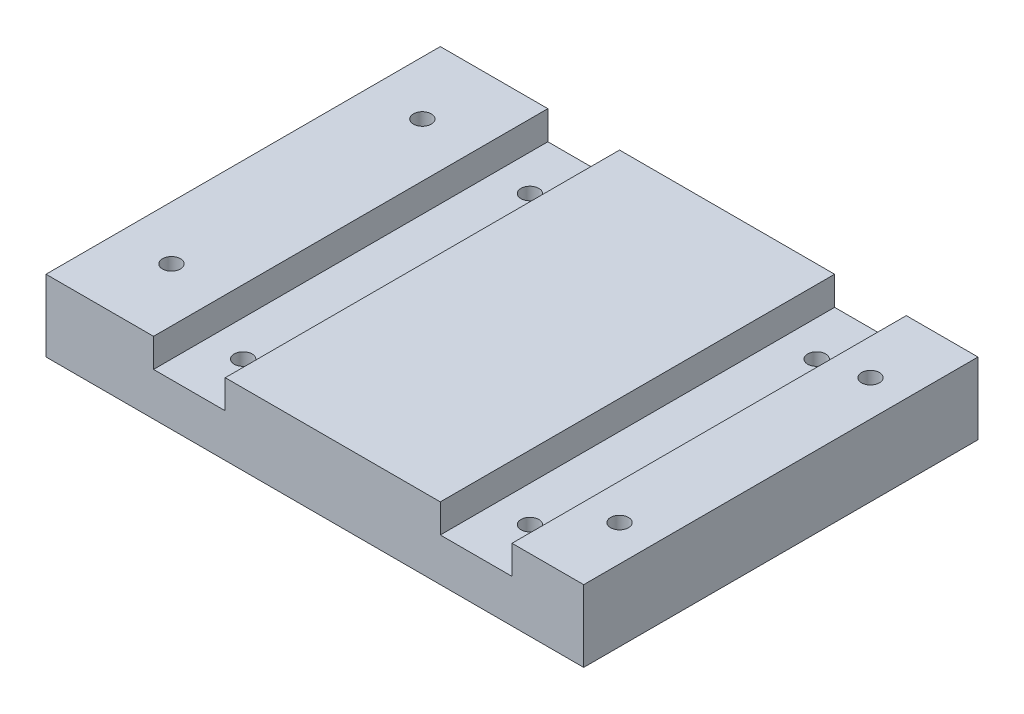
ISO-10303-21;
HEADER;
FILE_DESCRIPTION(('STEP AP214'),'2;1');
FILE_NAME('part.step','',(''),(''),'','','');
FILE_SCHEMA(('AUTOMOTIVE_DESIGN { 1 0 10303 214 1 1 1 1 }'));
ENDSEC;
DATA;
#1=APPLICATION_CONTEXT('core data for automotive mechanical design processes');
#2=APPLICATION_PROTOCOL_DEFINITION('international standard','automotive_design',2000,#1);
#3=PRODUCT_CONTEXT('',#1,'mechanical');
#4=PRODUCT('Part','Part','',(#3));
#5=PRODUCT_RELATED_PRODUCT_CATEGORY('part','',(#4));
#6=PRODUCT_DEFINITION_FORMATION('','',#4);
#7=PRODUCT_DEFINITION_CONTEXT('part definition',#1,'design');
#8=PRODUCT_DEFINITION('design','',#6,#7);
#9=PRODUCT_DEFINITION_SHAPE('','',#8);
#10=(LENGTH_UNIT() NAMED_UNIT(*) SI_UNIT(.MILLI.,.METRE.));
#11=(NAMED_UNIT(*) PLANE_ANGLE_UNIT() SI_UNIT($,.RADIAN.));
#12=(NAMED_UNIT(*) SI_UNIT($,.STERADIAN.) SOLID_ANGLE_UNIT());
#13=UNCERTAINTY_MEASURE_WITH_UNIT(LENGTH_MEASURE(1.E-05),#10,'distance_accuracy_value','');
#14=(GEOMETRIC_REPRESENTATION_CONTEXT(3) GLOBAL_UNCERTAINTY_ASSIGNED_CONTEXT((#13)) GLOBAL_UNIT_ASSIGNED_CONTEXT((#10,
#11,#12)) REPRESENTATION_CONTEXT('',''));
#15=CARTESIAN_POINT('',(0.,0.,0.));
#16=DIRECTION('',(0.,0.,1.));
#17=DIRECTION('',(1.,0.,0.));
#18=AXIS2_PLACEMENT_3D('',#15,#16,#17);
#19=CARTESIAN_POINT('',(-74.4140625000001,20.,110.));
#20=DIRECTION('',(1.,0.,0.));
#21=DIRECTION('',(0.,0.,-1.));
#22=AXIS2_PLACEMENT_3D('',#19,#20,#21);
#23=PLANE('',#22);
#24=DIRECTION('',(0.,-1.,0.));
#25=VECTOR('',#24,1.);
#26=CARTESIAN_POINT('',(-74.4140625000001,20.,0.));
#27=LINE('',#26,#25);
#28=CARTESIAN_POINT('',(-74.4140625000001,20.,0.));
#29=VERTEX_POINT('',#28);
#30=CARTESIAN_POINT('',(-74.4140625000001,0.,0.));
#31=VERTEX_POINT('',#30);
#32=EDGE_CURVE('E153',#29,#31,#27,.T.);
#33=ORIENTED_EDGE('',*,*,#32,.T.);
#34=DIRECTION('',(0.,0.,-1.));
#35=VECTOR('',#34,1.);
#36=CARTESIAN_POINT('',(-74.4140625000001,0.,110.));
#37=LINE('',#36,#35);
#38=CARTESIAN_POINT('',(-74.4140625000001,0.,110.));
#39=VERTEX_POINT('',#38);
#40=EDGE_CURVE('E11',#39,#31,#37,.T.);
#41=ORIENTED_EDGE('',*,*,#40,.F.);
#42=DIRECTION('',(0.,-1.,0.));
#43=VECTOR('',#42,1.);
#44=CARTESIAN_POINT('',(-74.4140625000001,20.,110.));
#45=LINE('',#44,#43);
#46=CARTESIAN_POINT('',(-74.4140625000001,20.,110.));
#47=VERTEX_POINT('',#46);
#48=EDGE_CURVE('E176',#47,#39,#45,.T.);
#49=ORIENTED_EDGE('',*,*,#48,.F.);
#50=DIRECTION('',(0.,0.,-1.));
#51=VECTOR('',#50,1.);
#52=CARTESIAN_POINT('',(-74.4140625000001,20.,110.));
#53=LINE('',#52,#51);
#54=EDGE_CURVE('E149',#47,#29,#53,.T.);
#55=ORIENTED_EDGE('',*,*,#54,.T.);
#56=EDGE_LOOP('',(#33,#41,#49,#55));
#57=FACE_BOUND('',#56,.T.);
#58=ADVANCED_FACE('F33',(#57),#23,.F.);
#59=CARTESIAN_POINT('',(-74.4140625000001,0.,110.));
#60=DIRECTION('',(0.,1.,0.));
#61=DIRECTION('',(0.,0.,1.));
#62=AXIS2_PLACEMENT_3D('',#59,#60,#61);
#63=PLANE('',#62);
#64=CARTESIAN_POINT('',(-34.4140625000001,0.,15.));
#65=DIRECTION('',(0.,1.,0.));
#66=DIRECTION('',(0.,0.,1.));
#67=AXIS2_PLACEMENT_3D('',#64,#65,#66);
#68=CIRCLE('',#67,2.49999999999999);
#69=CARTESIAN_POINT('',(-34.4140625000001,0.,17.5));
#70=VERTEX_POINT('',#69);
#71=EDGE_CURVE('E301',#70,#70,#68,.T.);
#72=ORIENTED_EDGE('',*,*,#71,.T.);
#73=EDGE_LOOP('',(#72));
#74=FACE_BOUND('',#73,.T.);
#75=CARTESIAN_POINT('',(-34.4140625000001,0.,95.));
#76=DIRECTION('',(0.,1.,0.));
#77=DIRECTION('',(0.,0.,1.));
#78=AXIS2_PLACEMENT_3D('',#75,#76,#77);
#79=CIRCLE('',#78,2.49999999999999);
#80=CARTESIAN_POINT('',(-34.4140625000001,0.,97.5));
#81=VERTEX_POINT('',#80);
#82=EDGE_CURVE('E300',#81,#81,#79,.T.);
#83=ORIENTED_EDGE('',*,*,#82,.T.);
#84=EDGE_LOOP('',(#83));
#85=FACE_BOUND('',#84,.T.);
#86=CARTESIAN_POINT('',(45.5859374999999,0.,15.));
#87=DIRECTION('',(0.,1.,0.));
#88=DIRECTION('',(0.,0.,1.));
#89=AXIS2_PLACEMENT_3D('',#86,#87,#88);
#90=CIRCLE('',#89,2.49999999999999);
#91=CARTESIAN_POINT('',(45.5859374999999,0.,17.5));
#92=VERTEX_POINT('',#91);
#93=EDGE_CURVE('E311',#92,#92,#90,.T.);
#94=ORIENTED_EDGE('',*,*,#93,.T.);
#95=EDGE_LOOP('',(#94));
#96=FACE_BOUND('',#95,.T.);
#97=CARTESIAN_POINT('',(45.5859374999999,0.,95.));
#98=DIRECTION('',(0.,1.,0.));
#99=DIRECTION('',(0.,0.,1.));
#100=AXIS2_PLACEMENT_3D('',#97,#98,#99);
#101=CIRCLE('',#100,2.49999999999999);
#102=CARTESIAN_POINT('',(45.5859374999999,0.,97.5));
#103=VERTEX_POINT('',#102);
#104=EDGE_CURVE('E317',#103,#103,#101,.T.);
#105=ORIENTED_EDGE('',*,*,#104,.T.);
#106=EDGE_LOOP('',(#105));
#107=FACE_BOUND('',#106,.T.);
#108=CARTESIAN_POINT('',(-59.4140625000001,0.,20.));
#109=DIRECTION('',(0.,1.,0.));
#110=DIRECTION('',(0.,0.,1.));
#111=AXIS2_PLACEMENT_3D('',#108,#109,#110);
#112=CIRCLE('',#111,2.5);
#113=CARTESIAN_POINT('',(-59.4140625000001,0.,22.5));
#114=VERTEX_POINT('',#113);
#115=EDGE_CURVE('E323',#114,#114,#112,.T.);
#116=ORIENTED_EDGE('',*,*,#115,.T.);
#117=EDGE_LOOP('',(#116));
#118=FACE_BOUND('',#117,.T.);
#119=CARTESIAN_POINT('',(-59.4140625000001,0.,90.));
#120=DIRECTION('',(0.,1.,0.));
#121=DIRECTION('',(0.,0.,1.));
#122=AXIS2_PLACEMENT_3D('',#119,#120,#121);
#123=CIRCLE('',#122,2.5);
#124=CARTESIAN_POINT('',(-59.4140625000001,0.,92.5));
#125=VERTEX_POINT('',#124);
#126=EDGE_CURVE('E329',#125,#125,#123,.T.);
#127=ORIENTED_EDGE('',*,*,#126,.T.);
#128=EDGE_LOOP('',(#127));
#129=FACE_BOUND('',#128,.T.);
#130=CARTESIAN_POINT('',(65.5859374999999,0.,20.));
#131=DIRECTION('',(0.,1.,0.));
#132=DIRECTION('',(0.,0.,1.));
#133=AXIS2_PLACEMENT_3D('',#130,#131,#132);
#134=CIRCLE('',#133,2.5);
#135=CARTESIAN_POINT('',(65.5859374999999,0.,22.5));
#136=VERTEX_POINT('',#135);
#137=EDGE_CURVE('E335',#136,#136,#134,.T.);
#138=ORIENTED_EDGE('',*,*,#137,.T.);
#139=EDGE_LOOP('',(#138));
#140=FACE_BOUND('',#139,.T.);
#141=CARTESIAN_POINT('',(65.5859374999999,0.,90.));
#142=DIRECTION('',(0.,1.,0.));
#143=DIRECTION('',(0.,0.,1.));
#144=AXIS2_PLACEMENT_3D('',#141,#142,#143);
#145=CIRCLE('',#144,2.5);
#146=CARTESIAN_POINT('',(65.5859374999999,0.,92.5));
#147=VERTEX_POINT('',#146);
#148=EDGE_CURVE('E157',#147,#147,#145,.T.);
#149=ORIENTED_EDGE('',*,*,#148,.T.);
#150=EDGE_LOOP('',(#149));
#151=FACE_BOUND('',#150,.T.);
#152=DIRECTION('',(1.,0.,0.));
#153=VECTOR('',#152,1.);
#154=CARTESIAN_POINT('',(-74.4140625000001,0.,0.));
#155=LINE('',#154,#153);
#156=CARTESIAN_POINT('',(75.5859374999999,0.,0.));
#157=VERTEX_POINT('',#156);
#158=EDGE_CURVE('E156',#31,#157,#155,.T.);
#159=ORIENTED_EDGE('',*,*,#158,.T.);
#160=DIRECTION('',(0.,0.,-1.));
#161=VECTOR('',#160,1.);
#162=CARTESIAN_POINT('',(75.5859374999999,0.,110.));
#163=LINE('',#162,#161);
#164=CARTESIAN_POINT('',(75.5859374999999,0.,110.));
#165=VERTEX_POINT('',#164);
#166=EDGE_CURVE('E41',#165,#157,#163,.T.);
#167=ORIENTED_EDGE('',*,*,#166,.F.);
#168=DIRECTION('',(1.,0.,0.));
#169=VECTOR('',#168,1.);
#170=CARTESIAN_POINT('',(-74.4140625000001,0.,110.));
#171=LINE('',#170,#169);
#172=EDGE_CURVE('E104',#39,#165,#171,.T.);
#173=ORIENTED_EDGE('',*,*,#172,.F.);
#174=ORIENTED_EDGE('',*,*,#40,.T.);
#175=EDGE_LOOP('',(#159,#167,#173,#174));
#176=FACE_BOUND('',#175,.T.);
#177=ADVANCED_FACE('F257',(#74,#85,#96,#107,#118,#129,#140,#151,#176),#63,.F.);
#178=CARTESIAN_POINT('',(75.5859374999999,0.,110.));
#179=DIRECTION('',(-1.,0.,0.));
#180=DIRECTION('',(0.,0.,1.));
#181=AXIS2_PLACEMENT_3D('',#178,#179,#180);
#182=PLANE('',#181);
#183=DIRECTION('',(0.,1.,0.));
#184=VECTOR('',#183,1.);
#185=CARTESIAN_POINT('',(75.5859374999999,0.,0.));
#186=LINE('',#185,#184);
#187=CARTESIAN_POINT('',(75.5859374999999,20.,0.));
#188=VERTEX_POINT('',#187);
#189=EDGE_CURVE('E159',#157,#188,#186,.T.);
#190=ORIENTED_EDGE('',*,*,#189,.T.);
#191=DIRECTION('',(0.,0.,-1.));
#192=VECTOR('',#191,1.);
#193=CARTESIAN_POINT('',(75.5859374999999,20.,110.));
#194=LINE('',#193,#192);
#195=CARTESIAN_POINT('',(75.5859374999999,20.,110.));
#196=VERTEX_POINT('',#195);
#197=EDGE_CURVE('E195',#196,#188,#194,.T.);
#198=ORIENTED_EDGE('',*,*,#197,.F.);
#199=DIRECTION('',(0.,1.,0.));
#200=VECTOR('',#199,1.);
#201=CARTESIAN_POINT('',(75.5859374999999,0.,110.));
#202=LINE('',#201,#200);
#203=EDGE_CURVE('E203',#165,#196,#202,.T.);
#204=ORIENTED_EDGE('',*,*,#203,.F.);
#205=ORIENTED_EDGE('',*,*,#166,.T.);
#206=EDGE_LOOP('',(#190,#198,#204,#205));
#207=FACE_BOUND('',#206,.T.);
#208=ADVANCED_FACE('F201',(#207),#182,.F.);
#209=CARTESIAN_POINT('',(75.5859374999999,20.,110.));
#210=DIRECTION('',(0.,-1.,0.));
#211=DIRECTION('',(1.,0.,0.));
#212=AXIS2_PLACEMENT_3D('',#209,#210,#211);
#213=PLANE('',#212);
#214=CARTESIAN_POINT('',(65.5859374999999,20.,20.));
#215=DIRECTION('',(0.,1.,0.));
#216=DIRECTION('',(0.,0.,1.));
#217=AXIS2_PLACEMENT_3D('',#214,#215,#216);
#218=CIRCLE('',#217,2.5);
#219=CARTESIAN_POINT('',(65.5859374999999,20.,22.5));
#220=VERTEX_POINT('',#219);
#221=EDGE_CURVE('E332',#220,#220,#218,.T.);
#222=ORIENTED_EDGE('',*,*,#221,.F.);
#223=EDGE_LOOP('',(#222));
#224=FACE_BOUND('',#223,.T.);
#225=CARTESIAN_POINT('',(65.5859374999999,20.,90.));
#226=DIRECTION('',(0.,1.,0.));
#227=DIRECTION('',(0.,0.,1.));
#228=AXIS2_PLACEMENT_3D('',#225,#226,#227);
#229=CIRCLE('',#228,2.5);
#230=CARTESIAN_POINT('',(65.5859374999999,20.,92.5));
#231=VERTEX_POINT('',#230);
#232=EDGE_CURVE('E338',#231,#231,#229,.T.);
#233=ORIENTED_EDGE('',*,*,#232,.F.);
#234=EDGE_LOOP('',(#233));
#235=FACE_BOUND('',#234,.T.);
#236=DIRECTION('',(-1.,0.,0.));
#237=VECTOR('',#236,1.);
#238=CARTESIAN_POINT('',(75.5859374999999,20.,0.));
#239=LINE('',#238,#237);
#240=CARTESIAN_POINT('',(55.5859374999999,20.,0.));
#241=VERTEX_POINT('',#240);
#242=EDGE_CURVE('E161',#188,#241,#239,.T.);
#243=ORIENTED_EDGE('',*,*,#242,.T.);
#244=DIRECTION('',(0.,0.,-1.));
#245=VECTOR('',#244,1.);
#246=CARTESIAN_POINT('',(55.5859374999999,20.,110.));
#247=LINE('',#246,#245);
#248=CARTESIAN_POINT('',(55.5859374999999,20.,110.));
#249=VERTEX_POINT('',#248);
#250=EDGE_CURVE('E192',#249,#241,#247,.T.);
#251=ORIENTED_EDGE('',*,*,#250,.F.);
#252=DIRECTION('',(-1.,0.,0.));
#253=VECTOR('',#252,1.);
#254=CARTESIAN_POINT('',(75.5859374999999,20.,110.));
#255=LINE('',#254,#253);
#256=EDGE_CURVE('E221',#196,#249,#255,.T.);
#257=ORIENTED_EDGE('',*,*,#256,.F.);
#258=ORIENTED_EDGE('',*,*,#197,.T.);
#259=EDGE_LOOP('',(#243,#251,#257,#258));
#260=FACE_BOUND('',#259,.T.);
#261=ADVANCED_FACE('F212',(#224,#235,#260),#213,.F.);
#262=CARTESIAN_POINT('',(55.5859374999999,20.,110.));
#263=DIRECTION('',(1.,0.,0.));
#264=DIRECTION('',(0.,0.,-1.));
#265=AXIS2_PLACEMENT_3D('',#262,#263,#264);
#266=PLANE('',#265);
#267=DIRECTION('',(0.,-1.,0.));
#268=VECTOR('',#267,1.);
#269=CARTESIAN_POINT('',(55.5859374999999,20.,0.));
#270=LINE('',#269,#268);
#271=CARTESIAN_POINT('',(55.5859374999999,12.,0.));
#272=VERTEX_POINT('',#271);
#273=EDGE_CURVE('E163',#241,#272,#270,.T.);
#274=ORIENTED_EDGE('',*,*,#273,.T.);
#275=DIRECTION('',(0.,0.,-1.));
#276=VECTOR('',#275,1.);
#277=CARTESIAN_POINT('',(55.5859374999999,12.,110.));
#278=LINE('',#277,#276);
#279=CARTESIAN_POINT('',(55.5859374999999,12.,110.));
#280=VERTEX_POINT('',#279);
#281=EDGE_CURVE('E189',#280,#272,#278,.T.);
#282=ORIENTED_EDGE('',*,*,#281,.F.);
#283=DIRECTION('',(0.,-1.,0.));
#284=VECTOR('',#283,1.);
#285=CARTESIAN_POINT('',(55.5859374999999,20.,110.));
#286=LINE('',#285,#284);
#287=EDGE_CURVE('E218',#249,#280,#286,.T.);
#288=ORIENTED_EDGE('',*,*,#287,.F.);
#289=ORIENTED_EDGE('',*,*,#250,.T.);
#290=EDGE_LOOP('',(#274,#282,#288,#289));
#291=FACE_BOUND('',#290,.T.);
#292=ADVANCED_FACE('F216',(#291),#266,.F.);
#293=CARTESIAN_POINT('',(55.5859374999999,12.,110.));
#294=DIRECTION('',(0.,-1.,0.));
#295=DIRECTION('',(1.,0.,0.));
#296=AXIS2_PLACEMENT_3D('',#293,#294,#295);
#297=PLANE('',#296);
#298=CARTESIAN_POINT('',(45.5859374999999,12.,15.));
#299=DIRECTION('',(0.,1.,0.));
#300=DIRECTION('',(0.,0.,1.));
#301=AXIS2_PLACEMENT_3D('',#298,#299,#300);
#302=CIRCLE('',#301,2.49999999999999);
#303=CARTESIAN_POINT('',(45.5859374999999,12.,17.5));
#304=VERTEX_POINT('',#303);
#305=EDGE_CURVE('E304',#304,#304,#302,.T.);
#306=ORIENTED_EDGE('',*,*,#305,.F.);
#307=EDGE_LOOP('',(#306));
#308=FACE_BOUND('',#307,.T.);
#309=CARTESIAN_POINT('',(45.5859374999999,12.,95.));
#310=DIRECTION('',(0.,1.,0.));
#311=DIRECTION('',(0.,0.,1.));
#312=AXIS2_PLACEMENT_3D('',#309,#310,#311);
#313=CIRCLE('',#312,2.49999999999999);
#314=CARTESIAN_POINT('',(45.5859374999999,12.,97.5));
#315=VERTEX_POINT('',#314);
#316=EDGE_CURVE('E314',#315,#315,#313,.T.);
#317=ORIENTED_EDGE('',*,*,#316,.F.);
#318=EDGE_LOOP('',(#317));
#319=FACE_BOUND('',#318,.T.);
#320=DIRECTION('',(-1.,0.,0.));
#321=VECTOR('',#320,1.);
#322=CARTESIAN_POINT('',(55.5859374999999,12.,0.));
#323=LINE('',#322,#321);
#324=CARTESIAN_POINT('',(35.5859374999999,12.,0.));
#325=VERTEX_POINT('',#324);
#326=EDGE_CURVE('E165',#272,#325,#323,.T.);
#327=ORIENTED_EDGE('',*,*,#326,.T.);
#328=DIRECTION('',(0.,0.,-1.));
#329=VECTOR('',#328,1.);
#330=CARTESIAN_POINT('',(35.5859374999999,12.,110.));
#331=LINE('',#330,#329);
#332=CARTESIAN_POINT('',(35.5859374999999,12.,110.));
#333=VERTEX_POINT('',#332);
#334=EDGE_CURVE('E186',#333,#325,#331,.T.);
#335=ORIENTED_EDGE('',*,*,#334,.F.);
#336=DIRECTION('',(-1.,0.,0.));
#337=VECTOR('',#336,1.);
#338=CARTESIAN_POINT('',(55.5859374999999,12.,110.));
#339=LINE('',#338,#337);
#340=EDGE_CURVE('E220',#280,#333,#339,.T.);
#341=ORIENTED_EDGE('',*,*,#340,.F.);
#342=ORIENTED_EDGE('',*,*,#281,.T.);
#343=EDGE_LOOP('',(#327,#335,#341,#342));
#344=FACE_BOUND('',#343,.T.);
#345=ADVANCED_FACE('F276',(#308,#319,#344),#297,.F.);
#346=CARTESIAN_POINT('',(35.5859374999999,12.,110.));
#347=DIRECTION('',(-1.,0.,0.));
#348=DIRECTION('',(0.,0.,1.));
#349=AXIS2_PLACEMENT_3D('',#346,#347,#348);
#350=PLANE('',#349);
#351=DIRECTION('',(0.,1.,0.));
#352=VECTOR('',#351,1.);
#353=CARTESIAN_POINT('',(35.5859374999999,12.,0.));
#354=LINE('',#353,#352);
#355=CARTESIAN_POINT('',(35.5859374999999,20.,0.));
#356=VERTEX_POINT('',#355);
#357=EDGE_CURVE('E167',#325,#356,#354,.T.);
#358=ORIENTED_EDGE('',*,*,#357,.T.);
#359=DIRECTION('',(0.,0.,-1.));
#360=VECTOR('',#359,1.);
#361=CARTESIAN_POINT('',(35.5859374999999,20.,110.));
#362=LINE('',#361,#360);
#363=CARTESIAN_POINT('',(35.5859374999999,20.,110.));
#364=VERTEX_POINT('',#363);
#365=EDGE_CURVE('E183',#364,#356,#362,.T.);
#366=ORIENTED_EDGE('',*,*,#365,.F.);
#367=DIRECTION('',(0.,1.,0.));
#368=VECTOR('',#367,1.);
#369=CARTESIAN_POINT('',(35.5859374999999,12.,110.));
#370=LINE('',#369,#368);
#371=EDGE_CURVE('E223',#333,#364,#370,.T.);
#372=ORIENTED_EDGE('',*,*,#371,.F.);
#373=ORIENTED_EDGE('',*,*,#334,.T.);
#374=EDGE_LOOP('',(#358,#366,#372,#373));
#375=FACE_BOUND('',#374,.T.);
#376=ADVANCED_FACE('F278',(#375),#350,.F.);
#377=CARTESIAN_POINT('',(35.5859374999999,20.,110.));
#378=DIRECTION('',(0.,-1.,0.));
#379=DIRECTION('',(1.,0.,0.));
#380=AXIS2_PLACEMENT_3D('',#377,#378,#379);
#381=PLANE('',#380);
#382=DIRECTION('',(-1.,0.,0.));
#383=VECTOR('',#382,1.);
#384=CARTESIAN_POINT('',(35.5859374999999,20.,0.));
#385=LINE('',#384,#383);
#386=CARTESIAN_POINT('',(-24.4140625000001,20.,0.));
#387=VERTEX_POINT('',#386);
#388=EDGE_CURVE('E169',#356,#387,#385,.T.);
#389=ORIENTED_EDGE('',*,*,#388,.T.);
#390=DIRECTION('',(0.,0.,-1.));
#391=VECTOR('',#390,1.);
#392=CARTESIAN_POINT('',(-24.4140625000001,20.,110.));
#393=LINE('',#392,#391);
#394=CARTESIAN_POINT('',(-24.4140625000001,20.,110.));
#395=VERTEX_POINT('',#394);
#396=EDGE_CURVE('E180',#395,#387,#393,.T.);
#397=ORIENTED_EDGE('',*,*,#396,.F.);
#398=DIRECTION('',(-1.,0.,0.));
#399=VECTOR('',#398,1.);
#400=CARTESIAN_POINT('',(35.5859374999999,20.,110.));
#401=LINE('',#400,#399);
#402=EDGE_CURVE('E229',#364,#395,#401,.T.);
#403=ORIENTED_EDGE('',*,*,#402,.F.);
#404=ORIENTED_EDGE('',*,*,#365,.T.);
#405=EDGE_LOOP('',(#389,#397,#403,#404));
#406=FACE_BOUND('',#405,.T.);
#407=ADVANCED_FACE('F235',(#406),#381,.F.);
#408=CARTESIAN_POINT('',(-24.4140625000001,20.,110.));
#409=DIRECTION('',(1.,0.,0.));
#410=DIRECTION('',(0.,1.,0.));
#411=AXIS2_PLACEMENT_3D('',#408,#409,#410);
#412=PLANE('',#411);
#413=DIRECTION('',(0.,-1.,0.));
#414=VECTOR('',#413,1.);
#415=CARTESIAN_POINT('',(-24.4140625000001,20.,0.));
#416=LINE('',#415,#414);
#417=CARTESIAN_POINT('',(-24.4140625000001,12.,0.));
#418=VERTEX_POINT('',#417);
#419=EDGE_CURVE('E171',#387,#418,#416,.T.);
#420=ORIENTED_EDGE('',*,*,#419,.T.);
#421=DIRECTION('',(0.,0.,-1.));
#422=VECTOR('',#421,1.);
#423=CARTESIAN_POINT('',(-24.4140625000001,12.,110.));
#424=LINE('',#423,#422);
#425=CARTESIAN_POINT('',(-24.4140625000001,12.,110.));
#426=VERTEX_POINT('',#425);
#427=EDGE_CURVE('E144',#426,#418,#424,.T.);
#428=ORIENTED_EDGE('',*,*,#427,.F.);
#429=DIRECTION('',(0.,-1.,0.));
#430=VECTOR('',#429,1.);
#431=CARTESIAN_POINT('',(-24.4140625000001,20.,110.));
#432=LINE('',#431,#430);
#433=EDGE_CURVE('E135',#395,#426,#432,.T.);
#434=ORIENTED_EDGE('',*,*,#433,.F.);
#435=ORIENTED_EDGE('',*,*,#396,.T.);
#436=EDGE_LOOP('',(#420,#428,#434,#435));
#437=FACE_BOUND('',#436,.T.);
#438=ADVANCED_FACE('F239',(#437),#412,.F.);
#439=CARTESIAN_POINT('',(-24.4140625000001,12.,110.));
#440=DIRECTION('',(0.,-1.,0.));
#441=DIRECTION('',(1.,0.,0.));
#442=AXIS2_PLACEMENT_3D('',#439,#440,#441);
#443=PLANE('',#442);
#444=CARTESIAN_POINT('',(-34.4140625000001,12.,15.));
#445=DIRECTION('',(0.,1.,0.));
#446=DIRECTION('',(0.,0.,1.));
#447=AXIS2_PLACEMENT_3D('',#444,#445,#446);
#448=CIRCLE('',#447,2.49999999999999);
#449=CARTESIAN_POINT('',(-34.4140625000001,12.,17.5));
#450=VERTEX_POINT('',#449);
#451=EDGE_CURVE('E295',#450,#450,#448,.T.);
#452=ORIENTED_EDGE('',*,*,#451,.F.);
#453=EDGE_LOOP('',(#452));
#454=FACE_BOUND('',#453,.T.);
#455=CARTESIAN_POINT('',(-34.4140625000001,12.,95.));
#456=DIRECTION('',(0.,1.,0.));
#457=DIRECTION('',(0.,0.,1.));
#458=AXIS2_PLACEMENT_3D('',#455,#456,#457);
#459=CIRCLE('',#458,2.49999999999999);
#460=CARTESIAN_POINT('',(-34.4140625000001,12.,97.5));
#461=VERTEX_POINT('',#460);
#462=EDGE_CURVE('E298',#461,#461,#459,.T.);
#463=ORIENTED_EDGE('',*,*,#462,.F.);
#464=EDGE_LOOP('',(#463));
#465=FACE_BOUND('',#464,.T.);
#466=DIRECTION('',(-1.,0.,0.));
#467=VECTOR('',#466,1.);
#468=CARTESIAN_POINT('',(-24.4140625000001,12.,0.));
#469=LINE('',#468,#467);
#470=CARTESIAN_POINT('',(-44.4140625000001,12.,0.));
#471=VERTEX_POINT('',#470);
#472=EDGE_CURVE('E143',#418,#471,#469,.T.);
#473=ORIENTED_EDGE('',*,*,#472,.T.);
#474=DIRECTION('',(0.,0.,-1.));
#475=VECTOR('',#474,1.);
#476=CARTESIAN_POINT('',(-44.4140625000001,12.,110.));
#477=LINE('',#476,#475);
#478=CARTESIAN_POINT('',(-44.4140625000001,12.,110.));
#479=VERTEX_POINT('',#478);
#480=EDGE_CURVE('E140',#479,#471,#477,.T.);
#481=ORIENTED_EDGE('',*,*,#480,.F.);
#482=DIRECTION('',(-1.,0.,0.));
#483=VECTOR('',#482,1.);
#484=CARTESIAN_POINT('',(-24.4140625000001,12.,110.));
#485=LINE('',#484,#483);
#486=EDGE_CURVE('E129',#426,#479,#485,.T.);
#487=ORIENTED_EDGE('',*,*,#486,.F.);
#488=ORIENTED_EDGE('',*,*,#427,.T.);
#489=EDGE_LOOP('',(#473,#481,#487,#488));
#490=FACE_BOUND('',#489,.T.);
#491=ADVANCED_FACE('F141',(#454,#465,#490),#443,.F.);
#492=CARTESIAN_POINT('',(-44.4140625000001,12.,110.));
#493=DIRECTION('',(-1.,0.,0.));
#494=DIRECTION('',(0.,0.,1.));
#495=AXIS2_PLACEMENT_3D('',#492,#493,#494);
#496=PLANE('',#495);
#497=DIRECTION('',(0.,1.,0.));
#498=VECTOR('',#497,1.);
#499=CARTESIAN_POINT('',(-44.4140625000001,12.,0.));
#500=LINE('',#499,#498);
#501=CARTESIAN_POINT('',(-44.4140625000001,20.,0.));
#502=VERTEX_POINT('',#501);
#503=EDGE_CURVE('E90',#471,#502,#500,.T.);
#504=ORIENTED_EDGE('',*,*,#503,.T.);
#505=DIRECTION('',(0.,0.,-1.));
#506=VECTOR('',#505,1.);
#507=CARTESIAN_POINT('',(-44.4140625000001,20.,110.));
#508=LINE('',#507,#506);
#509=CARTESIAN_POINT('',(-44.4140625000001,20.,110.));
#510=VERTEX_POINT('',#509);
#511=EDGE_CURVE('E145',#510,#502,#508,.T.);
#512=ORIENTED_EDGE('',*,*,#511,.F.);
#513=DIRECTION('',(0.,1.,0.));
#514=VECTOR('',#513,1.);
#515=CARTESIAN_POINT('',(-44.4140625000001,12.,110.));
#516=LINE('',#515,#514);
#517=EDGE_CURVE('E133',#479,#510,#516,.T.);
#518=ORIENTED_EDGE('',*,*,#517,.F.);
#519=ORIENTED_EDGE('',*,*,#480,.T.);
#520=EDGE_LOOP('',(#504,#512,#518,#519));
#521=FACE_BOUND('',#520,.T.);
#522=ADVANCED_FACE('F147',(#521),#496,.F.);
#523=CARTESIAN_POINT('',(-44.4140625000001,20.,110.));
#524=DIRECTION('',(0.,-1.,0.));
#525=DIRECTION('',(1.,0.,0.));
#526=AXIS2_PLACEMENT_3D('',#523,#524,#525);
#527=PLANE('',#526);
#528=CARTESIAN_POINT('',(-59.4140625000001,20.,20.));
#529=DIRECTION('',(0.,1.,0.));
#530=DIRECTION('',(0.,0.,1.));
#531=AXIS2_PLACEMENT_3D('',#528,#529,#530);
#532=CIRCLE('',#531,2.5);
#533=CARTESIAN_POINT('',(-59.4140625000001,20.,22.5));
#534=VERTEX_POINT('',#533);
#535=EDGE_CURVE('E320',#534,#534,#532,.T.);
#536=ORIENTED_EDGE('',*,*,#535,.F.);
#537=EDGE_LOOP('',(#536));
#538=FACE_BOUND('',#537,.T.);
#539=CARTESIAN_POINT('',(-59.4140625000001,20.,90.));
#540=DIRECTION('',(0.,1.,0.));
#541=DIRECTION('',(0.,0.,1.));
#542=AXIS2_PLACEMENT_3D('',#539,#540,#541);
#543=CIRCLE('',#542,2.5);
#544=CARTESIAN_POINT('',(-59.4140625000001,20.,92.5));
#545=VERTEX_POINT('',#544);
#546=EDGE_CURVE('E326',#545,#545,#543,.T.);
#547=ORIENTED_EDGE('',*,*,#546,.F.);
#548=EDGE_LOOP('',(#547));
#549=FACE_BOUND('',#548,.T.);
#550=DIRECTION('',(-1.,0.,0.));
#551=VECTOR('',#550,1.);
#552=CARTESIAN_POINT('',(-44.4140625000001,20.,0.));
#553=LINE('',#552,#551);
#554=EDGE_CURVE('E96',#502,#29,#553,.T.);
#555=ORIENTED_EDGE('',*,*,#554,.T.);
#556=ORIENTED_EDGE('',*,*,#54,.F.);
#557=DIRECTION('',(-1.,0.,0.));
#558=VECTOR('',#557,1.);
#559=CARTESIAN_POINT('',(-44.4140625000001,20.,110.));
#560=LINE('',#559,#558);
#561=EDGE_CURVE('E49',#510,#47,#560,.T.);
#562=ORIENTED_EDGE('',*,*,#561,.F.);
#563=ORIENTED_EDGE('',*,*,#511,.T.);
#564=EDGE_LOOP('',(#555,#556,#562,#563));
#565=FACE_BOUND('',#564,.T.);
#566=ADVANCED_FACE('F243',(#538,#549,#565),#527,.F.);
#567=CARTESIAN_POINT('',(0.,0.,110.));
#568=DIRECTION('',(0.,0.,1.));
#569=DIRECTION('',(1.,0.,0.));
#570=AXIS2_PLACEMENT_3D('',#567,#568,#569);
#571=PLANE('',#570);
#572=ORIENTED_EDGE('',*,*,#48,.T.);
#573=ORIENTED_EDGE('',*,*,#172,.T.);
#574=ORIENTED_EDGE('',*,*,#203,.T.);
#575=ORIENTED_EDGE('',*,*,#256,.T.);
#576=ORIENTED_EDGE('',*,*,#287,.T.);
#577=ORIENTED_EDGE('',*,*,#340,.T.);
#578=ORIENTED_EDGE('',*,*,#371,.T.);
#579=ORIENTED_EDGE('',*,*,#402,.T.);
#580=ORIENTED_EDGE('',*,*,#433,.T.);
#581=ORIENTED_EDGE('',*,*,#486,.T.);
#582=ORIENTED_EDGE('',*,*,#517,.T.);
#583=ORIENTED_EDGE('',*,*,#561,.T.);
#584=EDGE_LOOP('',(#572,#573,#574,#575,#576,#577,#578,#579,#580,#581,#582,#583));
#585=FACE_BOUND('',#584,.T.);
#586=ADVANCED_FACE('F131',(#585),#571,.T.);
#587=CARTESIAN_POINT('',(0.,0.,0.));
#588=DIRECTION('',(0.,0.,1.));
#589=DIRECTION('',(1.,0.,0.));
#590=AXIS2_PLACEMENT_3D('',#587,#588,#589);
#591=PLANE('',#590);
#592=ORIENTED_EDGE('',*,*,#32,.F.);
#593=ORIENTED_EDGE('',*,*,#554,.F.);
#594=ORIENTED_EDGE('',*,*,#503,.F.);
#595=ORIENTED_EDGE('',*,*,#472,.F.);
#596=ORIENTED_EDGE('',*,*,#419,.F.);
#597=ORIENTED_EDGE('',*,*,#388,.F.);
#598=ORIENTED_EDGE('',*,*,#357,.F.);
#599=ORIENTED_EDGE('',*,*,#326,.F.);
#600=ORIENTED_EDGE('',*,*,#273,.F.);
#601=ORIENTED_EDGE('',*,*,#242,.F.);
#602=ORIENTED_EDGE('',*,*,#189,.F.);
#603=ORIENTED_EDGE('',*,*,#158,.F.);
#604=EDGE_LOOP('',(#592,#593,#594,#595,#596,#597,#598,#599,#600,#601,#602,#603));
#605=FACE_BOUND('',#604,.T.);
#606=ADVANCED_FACE('F207',(#605),#591,.F.);
#607=CARTESIAN_POINT('',(65.5859374999999,20.,90.));
#608=DIRECTION('',(0.,1.,0.));
#609=DIRECTION('',(0.,0.,1.));
#610=AXIS2_PLACEMENT_3D('',#607,#608,#609);
#611=CYLINDRICAL_SURFACE('',#610,2.5);
#612=ORIENTED_EDGE('',*,*,#148,.F.);
#613=EDGE_LOOP('',(#612));
#614=FACE_BOUND('',#613,.T.);
#615=ORIENTED_EDGE('',*,*,#232,.T.);
#616=EDGE_LOOP('',(#615));
#617=FACE_BOUND('',#616,.T.);
#618=ADVANCED_FACE('F347',(#614,#617),#611,.F.);
#619=CARTESIAN_POINT('',(65.5859374999999,20.,20.));
#620=DIRECTION('',(0.,1.,0.));
#621=DIRECTION('',(0.,0.,1.));
#622=AXIS2_PLACEMENT_3D('',#619,#620,#621);
#623=CYLINDRICAL_SURFACE('',#622,2.5);
#624=ORIENTED_EDGE('',*,*,#137,.F.);
#625=EDGE_LOOP('',(#624));
#626=FACE_BOUND('',#625,.T.);
#627=ORIENTED_EDGE('',*,*,#221,.T.);
#628=EDGE_LOOP('',(#627));
#629=FACE_BOUND('',#628,.T.);
#630=ADVANCED_FACE('F350',(#626,#629),#623,.F.);
#631=CARTESIAN_POINT('',(-59.4140625000001,20.,90.));
#632=DIRECTION('',(0.,1.,0.));
#633=DIRECTION('',(0.,0.,1.));
#634=AXIS2_PLACEMENT_3D('',#631,#632,#633);
#635=CYLINDRICAL_SURFACE('',#634,2.5);
#636=ORIENTED_EDGE('',*,*,#126,.F.);
#637=EDGE_LOOP('',(#636));
#638=FACE_BOUND('',#637,.T.);
#639=ORIENTED_EDGE('',*,*,#546,.T.);
#640=EDGE_LOOP('',(#639));
#641=FACE_BOUND('',#640,.T.);
#642=ADVANCED_FACE('F358',(#638,#641),#635,.F.);
#643=CARTESIAN_POINT('',(-59.4140625000001,20.,20.));
#644=DIRECTION('',(0.,1.,0.));
#645=DIRECTION('',(0.,0.,1.));
#646=AXIS2_PLACEMENT_3D('',#643,#644,#645);
#647=CYLINDRICAL_SURFACE('',#646,2.5);
#648=ORIENTED_EDGE('',*,*,#115,.F.);
#649=EDGE_LOOP('',(#648));
#650=FACE_BOUND('',#649,.T.);
#651=ORIENTED_EDGE('',*,*,#535,.T.);
#652=EDGE_LOOP('',(#651));
#653=FACE_BOUND('',#652,.T.);
#654=ADVANCED_FACE('F364',(#650,#653),#647,.F.);
#655=CARTESIAN_POINT('',(45.5859374999999,12.,95.));
#656=DIRECTION('',(0.,1.,0.));
#657=DIRECTION('',(0.,0.,1.));
#658=AXIS2_PLACEMENT_3D('',#655,#656,#657);
#659=CYLINDRICAL_SURFACE('',#658,2.49999999999999);
#660=ORIENTED_EDGE('',*,*,#104,.F.);
#661=EDGE_LOOP('',(#660));
#662=FACE_BOUND('',#661,.T.);
#663=ORIENTED_EDGE('',*,*,#316,.T.);
#664=EDGE_LOOP('',(#663));
#665=FACE_BOUND('',#664,.T.);
#666=ADVANCED_FACE('F368',(#662,#665),#659,.F.);
#667=CARTESIAN_POINT('',(45.5859374999999,12.,15.));
#668=DIRECTION('',(0.,1.,0.));
#669=DIRECTION('',(0.,0.,1.));
#670=AXIS2_PLACEMENT_3D('',#667,#668,#669);
#671=CYLINDRICAL_SURFACE('',#670,2.49999999999999);
#672=ORIENTED_EDGE('',*,*,#93,.F.);
#673=EDGE_LOOP('',(#672));
#674=FACE_BOUND('',#673,.T.);
#675=ORIENTED_EDGE('',*,*,#305,.T.);
#676=EDGE_LOOP('',(#675));
#677=FACE_BOUND('',#676,.T.);
#678=ADVANCED_FACE('F372',(#674,#677),#671,.F.);
#679=CARTESIAN_POINT('',(-34.4140625000001,12.,95.));
#680=DIRECTION('',(0.,1.,0.));
#681=DIRECTION('',(0.,0.,1.));
#682=AXIS2_PLACEMENT_3D('',#679,#680,#681);
#683=CYLINDRICAL_SURFACE('',#682,2.49999999999999);
#684=ORIENTED_EDGE('',*,*,#82,.F.);
#685=EDGE_LOOP('',(#684));
#686=FACE_BOUND('',#685,.T.);
#687=ORIENTED_EDGE('',*,*,#462,.T.);
#688=EDGE_LOOP('',(#687));
#689=FACE_BOUND('',#688,.T.);
#690=ADVANCED_FACE('F376',(#686,#689),#683,.F.);
#691=CARTESIAN_POINT('',(-34.4140625000001,12.,15.));
#692=DIRECTION('',(0.,1.,0.));
#693=DIRECTION('',(0.,0.,1.));
#694=AXIS2_PLACEMENT_3D('',#691,#692,#693);
#695=CYLINDRICAL_SURFACE('',#694,2.49999999999999);
#696=ORIENTED_EDGE('',*,*,#71,.F.);
#697=EDGE_LOOP('',(#696));
#698=FACE_BOUND('',#697,.T.);
#699=ORIENTED_EDGE('',*,*,#451,.T.);
#700=EDGE_LOOP('',(#699));
#701=FACE_BOUND('',#700,.T.);
#702=ADVANCED_FACE('F380',(#698,#701),#695,.F.);
#703=CLOSED_SHELL('',(#58,#177,#208,#261,#292,#345,#376,#407,#438,#491,#522,#566,#586,#606,#618,
#630,#642,#654,#666,#678,#690,#702));
#704=MANIFOLD_SOLID_BREP('B2',#703);
#705=ADVANCED_BREP_SHAPE_REPRESENTATION('',(#18,#704),#14);
#706=SHAPE_DEFINITION_REPRESENTATION(#9,#705);
ENDSEC;
END-ISO-10303-21;
